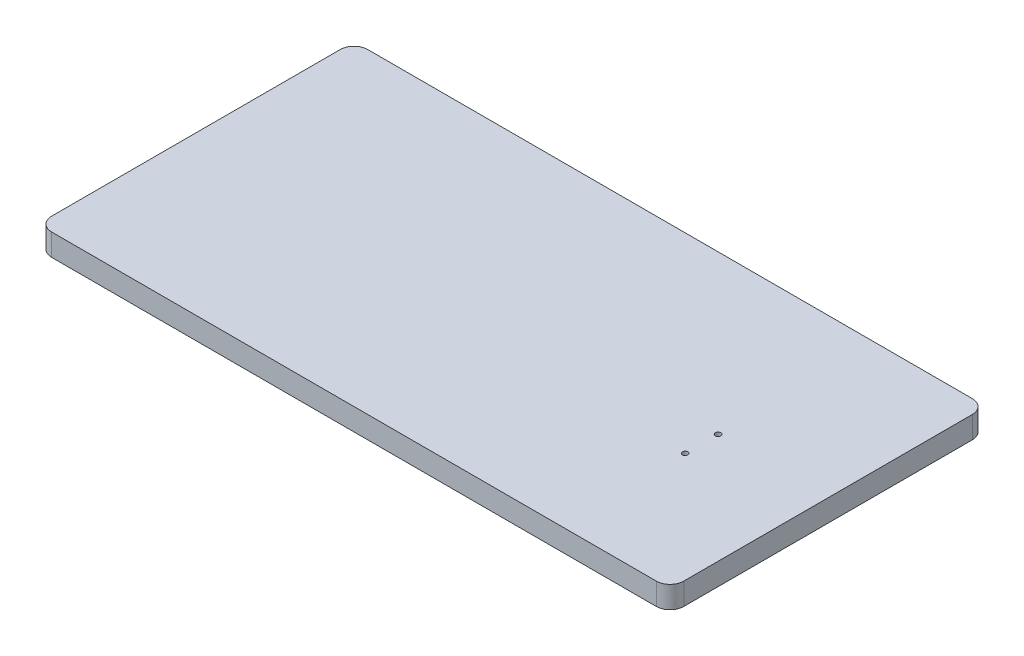
ISO-10303-21;
HEADER;
FILE_DESCRIPTION(('STEP AP214'),'2;1');
FILE_NAME('part.step','',(''),(''),'','','');
FILE_SCHEMA(('AUTOMOTIVE_DESIGN { 1 0 10303 214 1 1 1 1 }'));
ENDSEC;
DATA;
#1=APPLICATION_CONTEXT('core data for automotive mechanical design processes');
#2=APPLICATION_PROTOCOL_DEFINITION('international standard','automotive_design',2000,#1);
#3=PRODUCT_CONTEXT('',#1,'mechanical');
#4=PRODUCT('Part','Part','',(#3));
#5=PRODUCT_RELATED_PRODUCT_CATEGORY('part','',(#4));
#6=PRODUCT_DEFINITION_FORMATION('','',#4);
#7=PRODUCT_DEFINITION_CONTEXT('part definition',#1,'design');
#8=PRODUCT_DEFINITION('design','',#6,#7);
#9=PRODUCT_DEFINITION_SHAPE('','',#8);
#10=(LENGTH_UNIT() NAMED_UNIT(*) SI_UNIT(.MILLI.,.METRE.));
#11=(NAMED_UNIT(*) PLANE_ANGLE_UNIT() SI_UNIT($,.RADIAN.));
#12=(NAMED_UNIT(*) SI_UNIT($,.STERADIAN.) SOLID_ANGLE_UNIT());
#13=UNCERTAINTY_MEASURE_WITH_UNIT(LENGTH_MEASURE(1.E-05),#10,'distance_accuracy_value','');
#14=(GEOMETRIC_REPRESENTATION_CONTEXT(3) GLOBAL_UNCERTAINTY_ASSIGNED_CONTEXT((#13)) GLOBAL_UNIT_ASSIGNED_CONTEXT((#10,
#11,#12)) REPRESENTATION_CONTEXT('',''));
#15=CARTESIAN_POINT('',(0.,0.,0.));
#16=DIRECTION('',(0.,0.,1.));
#17=DIRECTION('',(1.,0.,0.));
#18=AXIS2_PLACEMENT_3D('',#15,#16,#17);
#19=CARTESIAN_POINT('',(0.,8.,-115.));
#20=DIRECTION('',(0.,0.,1.));
#21=DIRECTION('',(1.,0.,0.));
#22=AXIS2_PLACEMENT_3D('',#19,#20,#21);
#23=PLANE('',#22);
#24=DIRECTION('',(-1.,0.,0.));
#25=VECTOR('',#24,1.);
#26=CARTESIAN_POINT('',(0.,-8.,-115.));
#27=LINE('',#26,#25);
#28=CARTESIAN_POINT('',(557.5,-8.,-115.));
#29=VERTEX_POINT('',#28);
#30=CARTESIAN_POINT('',(117.5,-8.,-115.));
#31=VERTEX_POINT('',#30);
#32=EDGE_CURVE('E134',#29,#31,#27,.T.);
#33=ORIENTED_EDGE('',*,*,#32,.T.);
#34=DIRECTION('',(0.,-1.,0.));
#35=VECTOR('',#34,1.);
#36=CARTESIAN_POINT('',(117.5,8.,-115.));
#37=LINE('',#36,#35);
#38=CARTESIAN_POINT('',(117.5,8.,-115.));
#39=VERTEX_POINT('',#38);
#40=EDGE_CURVE('E11',#39,#31,#37,.T.);
#41=ORIENTED_EDGE('',*,*,#40,.F.);
#42=DIRECTION('',(-1.,0.,0.));
#43=VECTOR('',#42,1.);
#44=CARTESIAN_POINT('',(0.,8.,-115.));
#45=LINE('',#44,#43);
#46=CARTESIAN_POINT('',(557.5,8.,-115.));
#47=VERTEX_POINT('',#46);
#48=EDGE_CURVE('E154',#47,#39,#45,.T.);
#49=ORIENTED_EDGE('',*,*,#48,.F.);
#50=DIRECTION('',(0.,-1.,0.));
#51=VECTOR('',#50,1.);
#52=CARTESIAN_POINT('',(557.5,8.,-115.));
#53=LINE('',#52,#51);
#54=EDGE_CURVE('E53',#47,#29,#53,.T.);
#55=ORIENTED_EDGE('',*,*,#54,.T.);
#56=EDGE_LOOP('',(#33,#41,#49,#55));
#57=FACE_BOUND('',#56,.T.);
#58=ADVANCED_FACE('F37',(#57),#23,.F.);
#59=CARTESIAN_POINT('',(117.5,8.,-105.));
#60=DIRECTION('',(0.,-1.,0.));
#61=DIRECTION('',(0.,0.,-1.));
#62=AXIS2_PLACEMENT_3D('',#59,#60,#61);
#63=CYLINDRICAL_SURFACE('',#62,10.);
#64=CARTESIAN_POINT('',(117.5,-8.,-105.));
#65=DIRECTION('',(0.,1.,0.));
#66=DIRECTION('',(0.,0.,1.));
#67=AXIS2_PLACEMENT_3D('',#64,#65,#66);
#68=CIRCLE('',#67,10.);
#69=CARTESIAN_POINT('',(107.5,-8.,-105.));
#70=VERTEX_POINT('',#69);
#71=EDGE_CURVE('E136',#31,#70,#68,.T.);
#72=ORIENTED_EDGE('',*,*,#71,.T.);
#73=DIRECTION('',(0.,-1.,0.));
#74=VECTOR('',#73,1.);
#75=CARTESIAN_POINT('',(107.5,8.,-105.));
#76=LINE('',#75,#74);
#77=CARTESIAN_POINT('',(107.5,8.,-105.));
#78=VERTEX_POINT('',#77);
#79=EDGE_CURVE('E45',#78,#70,#76,.T.);
#80=ORIENTED_EDGE('',*,*,#79,.F.);
#81=CARTESIAN_POINT('',(117.5,8.,-105.));
#82=DIRECTION('',(0.,1.,0.));
#83=DIRECTION('',(0.,0.,1.));
#84=AXIS2_PLACEMENT_3D('',#81,#82,#83);
#85=CIRCLE('',#84,10.);
#86=EDGE_CURVE('E91',#39,#78,#85,.T.);
#87=ORIENTED_EDGE('',*,*,#86,.F.);
#88=ORIENTED_EDGE('',*,*,#40,.T.);
#89=EDGE_LOOP('',(#72,#80,#87,#88));
#90=FACE_BOUND('',#89,.T.);
#91=ADVANCED_FACE('F216',(#90),#63,.T.);
#92=CARTESIAN_POINT('',(107.5,8.,0.));
#93=DIRECTION('',(1.,0.,0.));
#94=DIRECTION('',(0.,0.,-1.));
#95=AXIS2_PLACEMENT_3D('',#92,#93,#94);
#96=PLANE('',#95);
#97=DIRECTION('',(0.,0.,1.));
#98=VECTOR('',#97,1.);
#99=CARTESIAN_POINT('',(107.5,-8.,0.));
#100=LINE('',#99,#98);
#101=CARTESIAN_POINT('',(107.5,-8.,105.));
#102=VERTEX_POINT('',#101);
#103=EDGE_CURVE('E139',#70,#102,#100,.T.);
#104=ORIENTED_EDGE('',*,*,#103,.T.);
#105=DIRECTION('',(0.,-1.,0.));
#106=VECTOR('',#105,1.);
#107=CARTESIAN_POINT('',(107.5,8.,105.));
#108=LINE('',#107,#106);
#109=CARTESIAN_POINT('',(107.5,8.,105.));
#110=VERTEX_POINT('',#109);
#111=EDGE_CURVE('E160',#110,#102,#108,.T.);
#112=ORIENTED_EDGE('',*,*,#111,.F.);
#113=DIRECTION('',(0.,0.,1.));
#114=VECTOR('',#113,1.);
#115=CARTESIAN_POINT('',(107.5,8.,0.));
#116=LINE('',#115,#114);
#117=EDGE_CURVE('E167',#78,#110,#116,.T.);
#118=ORIENTED_EDGE('',*,*,#117,.F.);
#119=ORIENTED_EDGE('',*,*,#79,.T.);
#120=EDGE_LOOP('',(#104,#112,#118,#119));
#121=FACE_BOUND('',#120,.T.);
#122=ADVANCED_FACE('F165',(#121),#96,.F.);
#123=CARTESIAN_POINT('',(117.5,8.,105.));
#124=DIRECTION('',(0.,-1.,0.));
#125=DIRECTION('',(0.,0.,-1.));
#126=AXIS2_PLACEMENT_3D('',#123,#124,#125);
#127=CYLINDRICAL_SURFACE('',#126,9.99999999999999);
#128=CARTESIAN_POINT('',(117.5,-8.,105.));
#129=DIRECTION('',(0.,1.,0.));
#130=DIRECTION('',(0.,0.,1.));
#131=AXIS2_PLACEMENT_3D('',#128,#129,#130);
#132=CIRCLE('',#131,9.99999999999999);
#133=CARTESIAN_POINT('',(117.5,-8.,115.));
#134=VERTEX_POINT('',#133);
#135=EDGE_CURVE('E142',#134,#102,#132,.F.);
#136=ORIENTED_EDGE('',*,*,#135,.F.);
#137=DIRECTION('',(0.,-1.,0.));
#138=VECTOR('',#137,1.);
#139=CARTESIAN_POINT('',(117.5,8.,115.));
#140=LINE('',#139,#138);
#141=CARTESIAN_POINT('',(117.5,8.,115.));
#142=VERTEX_POINT('',#141);
#143=EDGE_CURVE('E158',#142,#134,#140,.T.);
#144=ORIENTED_EDGE('',*,*,#143,.F.);
#145=CARTESIAN_POINT('',(117.5,8.,105.));
#146=DIRECTION('',(0.,1.,0.));
#147=DIRECTION('',(0.,0.,1.));
#148=AXIS2_PLACEMENT_3D('',#145,#146,#147);
#149=CIRCLE('',#148,9.99999999999999);
#150=EDGE_CURVE('E175',#142,#110,#149,.F.);
#151=ORIENTED_EDGE('',*,*,#150,.T.);
#152=ORIENTED_EDGE('',*,*,#111,.T.);
#153=EDGE_LOOP('',(#136,#144,#151,#152));
#154=FACE_BOUND('',#153,.T.);
#155=ADVANCED_FACE('F173',(#154),#127,.T.);
#156=CARTESIAN_POINT('',(0.,8.,115.));
#157=DIRECTION('',(0.,0.,1.));
#158=DIRECTION('',(1.,0.,0.));
#159=AXIS2_PLACEMENT_3D('',#156,#157,#158);
#160=PLANE('',#159);
#161=DIRECTION('',(-1.,0.,0.));
#162=VECTOR('',#161,1.);
#163=CARTESIAN_POINT('',(0.,-8.,115.));
#164=LINE('',#163,#162);
#165=CARTESIAN_POINT('',(557.5,-8.,115.));
#166=VERTEX_POINT('',#165);
#167=EDGE_CURVE('E145',#166,#134,#164,.T.);
#168=ORIENTED_EDGE('',*,*,#167,.F.);
#169=DIRECTION('',(0.,-1.,0.));
#170=VECTOR('',#169,1.);
#171=CARTESIAN_POINT('',(557.5,8.,115.));
#172=LINE('',#171,#170);
#173=CARTESIAN_POINT('',(557.5,8.,115.));
#174=VERTEX_POINT('',#173);
#175=EDGE_CURVE('E116',#174,#166,#172,.T.);
#176=ORIENTED_EDGE('',*,*,#175,.F.);
#177=DIRECTION('',(-1.,0.,0.));
#178=VECTOR('',#177,1.);
#179=CARTESIAN_POINT('',(0.,8.,115.));
#180=LINE('',#179,#178);
#181=EDGE_CURVE('E126',#174,#142,#180,.T.);
#182=ORIENTED_EDGE('',*,*,#181,.T.);
#183=ORIENTED_EDGE('',*,*,#143,.T.);
#184=EDGE_LOOP('',(#168,#176,#182,#183));
#185=FACE_BOUND('',#184,.T.);
#186=ADVANCED_FACE('F229',(#185),#160,.T.);
#187=CARTESIAN_POINT('',(557.5,8.,105.));
#188=DIRECTION('',(0.,-1.,0.));
#189=DIRECTION('',(0.,0.,-1.));
#190=AXIS2_PLACEMENT_3D('',#187,#188,#189);
#191=CYLINDRICAL_SURFACE('',#190,10.);
#192=CARTESIAN_POINT('',(557.5,-8.,105.));
#193=DIRECTION('',(0.,1.,0.));
#194=DIRECTION('',(0.,0.,1.));
#195=AXIS2_PLACEMENT_3D('',#192,#193,#194);
#196=CIRCLE('',#195,10.);
#197=CARTESIAN_POINT('',(567.5,-8.,105.));
#198=VERTEX_POINT('',#197);
#199=EDGE_CURVE('E112',#198,#166,#196,.F.);
#200=ORIENTED_EDGE('',*,*,#199,.F.);
#201=DIRECTION('',(0.,-1.,0.));
#202=VECTOR('',#201,1.);
#203=CARTESIAN_POINT('',(567.5,8.,105.));
#204=LINE('',#203,#202);
#205=CARTESIAN_POINT('',(567.5,8.,105.));
#206=VERTEX_POINT('',#205);
#207=EDGE_CURVE('E107',#206,#198,#204,.T.);
#208=ORIENTED_EDGE('',*,*,#207,.F.);
#209=CARTESIAN_POINT('',(557.5,8.,105.));
#210=DIRECTION('',(0.,1.,0.));
#211=DIRECTION('',(0.,0.,1.));
#212=AXIS2_PLACEMENT_3D('',#209,#210,#211);
#213=CIRCLE('',#212,10.);
#214=EDGE_CURVE('E110',#206,#174,#213,.F.);
#215=ORIENTED_EDGE('',*,*,#214,.T.);
#216=ORIENTED_EDGE('',*,*,#175,.T.);
#217=EDGE_LOOP('',(#200,#208,#215,#216));
#218=FACE_BOUND('',#217,.T.);
#219=ADVANCED_FACE('F109',(#218),#191,.T.);
#220=CARTESIAN_POINT('',(567.5,8.,0.));
#221=DIRECTION('',(1.,0.,0.));
#222=DIRECTION('',(0.,0.,-1.));
#223=AXIS2_PLACEMENT_3D('',#220,#221,#222);
#224=PLANE('',#223);
#225=DIRECTION('',(0.,0.,1.));
#226=VECTOR('',#225,1.);
#227=CARTESIAN_POINT('',(567.5,-8.,0.));
#228=LINE('',#227,#226);
#229=CARTESIAN_POINT('',(567.5,-8.,-105.));
#230=VERTEX_POINT('',#229);
#231=EDGE_CURVE('E149',#230,#198,#228,.T.);
#232=ORIENTED_EDGE('',*,*,#231,.F.);
#233=DIRECTION('',(0.,-1.,0.));
#234=VECTOR('',#233,1.);
#235=CARTESIAN_POINT('',(567.5,8.,-105.));
#236=LINE('',#235,#234);
#237=CARTESIAN_POINT('',(567.5,8.,-105.));
#238=VERTEX_POINT('',#237);
#239=EDGE_CURVE('E79',#238,#230,#236,.T.);
#240=ORIENTED_EDGE('',*,*,#239,.F.);
#241=DIRECTION('',(0.,0.,1.));
#242=VECTOR('',#241,1.);
#243=CARTESIAN_POINT('',(567.5,8.,0.));
#244=LINE('',#243,#242);
#245=EDGE_CURVE('E123',#238,#206,#244,.T.);
#246=ORIENTED_EDGE('',*,*,#245,.T.);
#247=ORIENTED_EDGE('',*,*,#207,.T.);
#248=EDGE_LOOP('',(#232,#240,#246,#247));
#249=FACE_BOUND('',#248,.T.);
#250=ADVANCED_FACE('F128',(#249),#224,.T.);
#251=CARTESIAN_POINT('',(557.5,8.,-105.));
#252=DIRECTION('',(0.,-1.,0.));
#253=DIRECTION('',(0.,0.,-1.));
#254=AXIS2_PLACEMENT_3D('',#251,#252,#253);
#255=CYLINDRICAL_SURFACE('',#254,10.);
#256=CARTESIAN_POINT('',(557.5,-8.,-105.));
#257=DIRECTION('',(0.,1.,0.));
#258=DIRECTION('',(0.,0.,1.));
#259=AXIS2_PLACEMENT_3D('',#256,#257,#258);
#260=CIRCLE('',#259,10.);
#261=EDGE_CURVE('E151',#29,#230,#260,.F.);
#262=ORIENTED_EDGE('',*,*,#261,.F.);
#263=ORIENTED_EDGE('',*,*,#54,.F.);
#264=CARTESIAN_POINT('',(557.5,8.,-105.));
#265=DIRECTION('',(0.,1.,0.));
#266=DIRECTION('',(0.,0.,1.));
#267=AXIS2_PLACEMENT_3D('',#264,#265,#266);
#268=CIRCLE('',#267,10.);
#269=EDGE_CURVE('E129',#47,#238,#268,.F.);
#270=ORIENTED_EDGE('',*,*,#269,.T.);
#271=ORIENTED_EDGE('',*,*,#239,.T.);
#272=EDGE_LOOP('',(#262,#263,#270,#271));
#273=FACE_BOUND('',#272,.T.);
#274=ADVANCED_FACE('F198',(#273),#255,.T.);
#275=CARTESIAN_POINT('',(0.,8.,0.));
#276=DIRECTION('',(0.,1.,0.));
#277=DIRECTION('',(0.,0.,1.));
#278=AXIS2_PLACEMENT_3D('',#275,#276,#277);
#279=PLANE('',#278);
#280=CARTESIAN_POINT('',(487.5,8.,0.));
#281=DIRECTION('',(0.,1.,0.));
#282=DIRECTION('',(0.,0.,-1.));
#283=AXIS2_PLACEMENT_3D('',#280,#281,#282);
#284=CIRCLE('',#283,2.);
#285=CARTESIAN_POINT('',(487.5,8.,-2.00000000000001));
#286=VERTEX_POINT('',#285);
#287=EDGE_CURVE('E189',#286,#286,#284,.T.);
#288=ORIENTED_EDGE('',*,*,#287,.F.);
#289=EDGE_LOOP('',(#288));
#290=FACE_BOUND('',#289,.T.);
#291=CARTESIAN_POINT('',(487.5,8.,24.));
#292=DIRECTION('',(0.,1.,0.));
#293=DIRECTION('',(0.,0.,-1.));
#294=AXIS2_PLACEMENT_3D('',#291,#292,#293);
#295=CIRCLE('',#294,2.);
#296=CARTESIAN_POINT('',(487.5,8.,22.));
#297=VERTEX_POINT('',#296);
#298=EDGE_CURVE('E183',#297,#297,#295,.T.);
#299=ORIENTED_EDGE('',*,*,#298,.F.);
#300=EDGE_LOOP('',(#299));
#301=FACE_BOUND('',#300,.T.);
#302=ORIENTED_EDGE('',*,*,#48,.T.);
#303=ORIENTED_EDGE('',*,*,#86,.T.);
#304=ORIENTED_EDGE('',*,*,#117,.T.);
#305=ORIENTED_EDGE('',*,*,#150,.F.);
#306=ORIENTED_EDGE('',*,*,#181,.F.);
#307=ORIENTED_EDGE('',*,*,#214,.F.);
#308=ORIENTED_EDGE('',*,*,#245,.F.);
#309=ORIENTED_EDGE('',*,*,#269,.F.);
#310=EDGE_LOOP('',(#302,#303,#304,#305,#306,#307,#308,#309));
#311=FACE_BOUND('',#310,.T.);
#312=ADVANCED_FACE('F121',(#290,#301,#311),#279,.T.);
#313=CARTESIAN_POINT('',(0.,-8.,0.));
#314=DIRECTION('',(0.,1.,0.));
#315=DIRECTION('',(0.,0.,1.));
#316=AXIS2_PLACEMENT_3D('',#313,#314,#315);
#317=PLANE('',#316);
#318=CARTESIAN_POINT('',(487.5,-8.,0.));
#319=DIRECTION('',(0.,1.,0.));
#320=DIRECTION('',(0.,0.,1.));
#321=AXIS2_PLACEMENT_3D('',#318,#319,#320);
#322=CIRCLE('',#321,2.);
#323=CARTESIAN_POINT('',(487.5,-8.,1.99999999999998));
#324=VERTEX_POINT('',#323);
#325=EDGE_CURVE('E186',#324,#324,#322,.F.);
#326=ORIENTED_EDGE('',*,*,#325,.F.);
#327=EDGE_LOOP('',(#326));
#328=FACE_BOUND('',#327,.T.);
#329=CARTESIAN_POINT('',(487.5,-8.,24.));
#330=DIRECTION('',(0.,1.,0.));
#331=DIRECTION('',(0.,0.,1.));
#332=AXIS2_PLACEMENT_3D('',#329,#330,#331);
#333=CIRCLE('',#332,2.);
#334=CARTESIAN_POINT('',(487.5,-8.,26.));
#335=VERTEX_POINT('',#334);
#336=EDGE_CURVE('E137',#335,#335,#333,.F.);
#337=ORIENTED_EDGE('',*,*,#336,.F.);
#338=EDGE_LOOP('',(#337));
#339=FACE_BOUND('',#338,.T.);
#340=ORIENTED_EDGE('',*,*,#32,.F.);
#341=ORIENTED_EDGE('',*,*,#261,.T.);
#342=ORIENTED_EDGE('',*,*,#231,.T.);
#343=ORIENTED_EDGE('',*,*,#199,.T.);
#344=ORIENTED_EDGE('',*,*,#167,.T.);
#345=ORIENTED_EDGE('',*,*,#135,.T.);
#346=ORIENTED_EDGE('',*,*,#103,.F.);
#347=ORIENTED_EDGE('',*,*,#71,.F.);
#348=EDGE_LOOP('',(#340,#341,#342,#343,#344,#345,#346,#347));
#349=FACE_BOUND('',#348,.T.);
#350=ADVANCED_FACE('F169',(#328,#339,#349),#317,.F.);
#351=CARTESIAN_POINT('',(487.5,-8.001,24.));
#352=DIRECTION('',(0.,1.,0.));
#353=DIRECTION('',(0.,0.,1.));
#354=AXIS2_PLACEMENT_3D('',#351,#352,#353);
#355=CYLINDRICAL_SURFACE('',#354,2.);
#356=ORIENTED_EDGE('',*,*,#298,.T.);
#357=EDGE_LOOP('',(#356));
#358=FACE_BOUND('',#357,.T.);
#359=ORIENTED_EDGE('',*,*,#336,.T.);
#360=EDGE_LOOP('',(#359));
#361=FACE_BOUND('',#360,.T.);
#362=ADVANCED_FACE('F202',(#358,#361),#355,.F.);
#363=CARTESIAN_POINT('',(487.5,-8.001,0.));
#364=DIRECTION('',(0.,1.,0.));
#365=DIRECTION('',(0.,0.,1.));
#366=AXIS2_PLACEMENT_3D('',#363,#364,#365);
#367=CYLINDRICAL_SURFACE('',#366,2.);
#368=ORIENTED_EDGE('',*,*,#287,.T.);
#369=EDGE_LOOP('',(#368));
#370=FACE_BOUND('',#369,.T.);
#371=ORIENTED_EDGE('',*,*,#325,.T.);
#372=EDGE_LOOP('',(#371));
#373=FACE_BOUND('',#372,.T.);
#374=ADVANCED_FACE('F193',(#370,#373),#367,.F.);
#375=CLOSED_SHELL('',(#58,#91,#122,#155,#186,#219,#250,#274,#312,#350,#362,#374));
#376=MANIFOLD_SOLID_BREP('B2',#375);
#377=ADVANCED_BREP_SHAPE_REPRESENTATION('',(#18,#376),#14);
#378=SHAPE_DEFINITION_REPRESENTATION(#9,#377);
ENDSEC;
END-ISO-10303-21;
